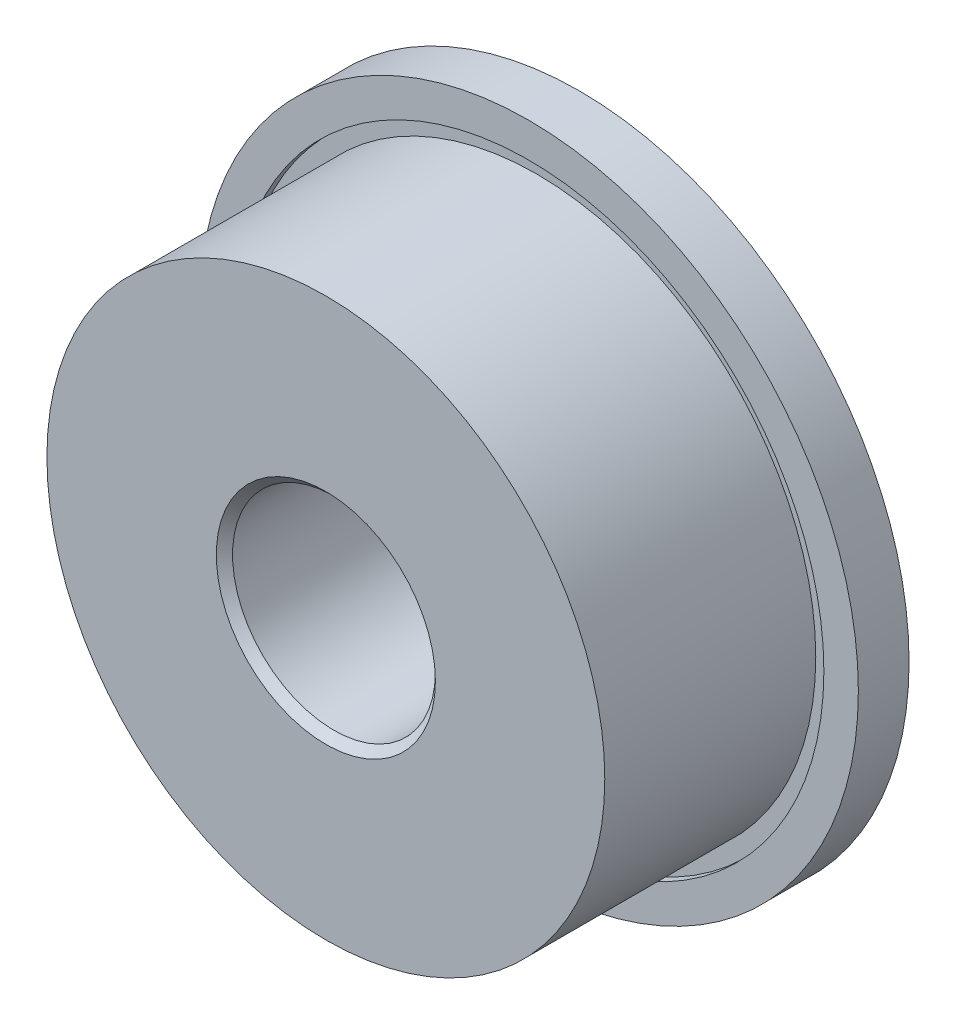
ISO-10303-21;
HEADER;
FILE_DESCRIPTION(('STEP AP214'),'2;1');
FILE_NAME('part.step','',(''),(''),'','','');
FILE_SCHEMA(('AUTOMOTIVE_DESIGN { 1 0 10303 214 1 1 1 1 }'));
ENDSEC;
DATA;
#1=APPLICATION_CONTEXT('core data for automotive mechanical design processes');
#2=APPLICATION_PROTOCOL_DEFINITION('international standard','automotive_design',2000,#1);
#3=PRODUCT_CONTEXT('',#1,'mechanical');
#4=PRODUCT('Part','Part','',(#3));
#5=PRODUCT_RELATED_PRODUCT_CATEGORY('part','',(#4));
#6=PRODUCT_DEFINITION_FORMATION('','',#4);
#7=PRODUCT_DEFINITION_CONTEXT('part definition',#1,'design');
#8=PRODUCT_DEFINITION('design','',#6,#7);
#9=PRODUCT_DEFINITION_SHAPE('','',#8);
#10=(LENGTH_UNIT() NAMED_UNIT(*) SI_UNIT(.MILLI.,.METRE.));
#11=(NAMED_UNIT(*) PLANE_ANGLE_UNIT() SI_UNIT($,.RADIAN.));
#12=(NAMED_UNIT(*) SI_UNIT($,.STERADIAN.) SOLID_ANGLE_UNIT());
#13=UNCERTAINTY_MEASURE_WITH_UNIT(LENGTH_MEASURE(1.E-05),#10,'distance_accuracy_value','');
#14=(GEOMETRIC_REPRESENTATION_CONTEXT(3) GLOBAL_UNCERTAINTY_ASSIGNED_CONTEXT((#13)) GLOBAL_UNIT_ASSIGNED_CONTEXT((#10,
#11,#12)) REPRESENTATION_CONTEXT('',''));
#15=CARTESIAN_POINT('',(0.,0.,0.));
#16=DIRECTION('',(0.,0.,1.));
#17=DIRECTION('',(1.,0.,0.));
#18=AXIS2_PLACEMENT_3D('',#15,#16,#17);
#19=CARTESIAN_POINT('',(0.,0.,1.5875));
#20=DIRECTION('',(0.,0.,-1.));
#21=DIRECTION('',(-1.,0.,0.));
#22=AXIS2_PLACEMENT_3D('',#19,#20,#21);
#23=CYLINDRICAL_SURFACE('',#22,10.31875);
#24=CARTESIAN_POINT('',(0.,0.,1.5875));
#25=DIRECTION('',(0.,0.,1.));
#26=DIRECTION('',(1.,0.,0.));
#27=AXIS2_PLACEMENT_3D('',#24,#25,#26);
#28=CIRCLE('',#27,10.31875);
#29=CARTESIAN_POINT('',(10.31875,0.,1.5875));
#30=VERTEX_POINT('',#29);
#31=EDGE_CURVE('E60',#30,#30,#28,.T.);
#32=ORIENTED_EDGE('',*,*,#31,.F.);
#33=EDGE_LOOP('',(#32));
#34=FACE_BOUND('',#33,.T.);
#35=CARTESIAN_POINT('',(0.,0.,0.));
#36=DIRECTION('',(0.,0.,1.));
#37=DIRECTION('',(1.,0.,0.));
#38=AXIS2_PLACEMENT_3D('',#35,#36,#37);
#39=CIRCLE('',#38,10.31875);
#40=CARTESIAN_POINT('',(10.31875,0.,0.));
#41=VERTEX_POINT('',#40);
#42=EDGE_CURVE('E61',#41,#41,#39,.T.);
#43=ORIENTED_EDGE('',*,*,#42,.T.);
#44=EDGE_LOOP('',(#43));
#45=FACE_BOUND('',#44,.T.);
#46=ADVANCED_FACE('F34',(#34,#45),#23,.T.);
#47=CARTESIAN_POINT('',(0.,0.,1.5875));
#48=DIRECTION('',(0.,0.,1.));
#49=DIRECTION('',(1.,0.,0.));
#50=AXIS2_PLACEMENT_3D('',#47,#48,#49);
#51=PLANE('',#50);
#52=CARTESIAN_POINT('',(0.,0.,1.5875));
#53=DIRECTION('',(0.,0.,1.));
#54=DIRECTION('',(1.,0.,0.));
#55=AXIS2_PLACEMENT_3D('',#52,#53,#54);
#56=CIRCLE('',#55,9.23925);
#57=CARTESIAN_POINT('',(9.23925,0.,1.5875));
#58=VERTEX_POINT('',#57);
#59=EDGE_CURVE('E82',#58,#58,#56,.T.);
#60=ORIENTED_EDGE('',*,*,#59,.F.);
#61=EDGE_LOOP('',(#60));
#62=FACE_BOUND('',#61,.T.);
#63=ORIENTED_EDGE('',*,*,#31,.T.);
#64=EDGE_LOOP('',(#63));
#65=FACE_BOUND('',#64,.T.);
#66=ADVANCED_FACE('F107',(#62,#65),#51,.T.);
#67=CARTESIAN_POINT('',(0.,0.,0.));
#68=DIRECTION('',(0.,0.,1.));
#69=DIRECTION('',(1.,0.,0.));
#70=AXIS2_PLACEMENT_3D('',#67,#68,#69);
#71=PLANE('',#70);
#72=CARTESIAN_POINT('',(0.,0.,0.));
#73=DIRECTION('',(0.,0.,1.));
#74=DIRECTION('',(1.,0.,0.));
#75=AXIS2_PLACEMENT_3D('',#72,#73,#74);
#76=CIRCLE('',#75,6.35);
#77=CARTESIAN_POINT('',(6.35,0.,0.));
#78=VERTEX_POINT('',#77);
#79=EDGE_CURVE('E57',#78,#78,#76,.F.);
#80=ORIENTED_EDGE('',*,*,#79,.F.);
#81=EDGE_LOOP('',(#80));
#82=FACE_BOUND('',#81,.T.);
#83=ORIENTED_EDGE('',*,*,#42,.F.);
#84=EDGE_LOOP('',(#83));
#85=FACE_BOUND('',#84,.T.);
#86=ADVANCED_FACE('F110',(#82,#85),#71,.F.);
#87=CARTESIAN_POINT('',(0.,0.,-1.5875));
#88=DIRECTION('',(0.,0.,1.));
#89=DIRECTION('',(1.,0.,0.));
#90=AXIS2_PLACEMENT_3D('',#87,#88,#89);
#91=CYLINDRICAL_SURFACE('',#90,6.35);
#92=CARTESIAN_POINT('',(0.,0.,-1.5875));
#93=DIRECTION('',(0.,0.,-1.));
#94=DIRECTION('',(-1.,0.,0.));
#95=AXIS2_PLACEMENT_3D('',#92,#93,#94);
#96=CIRCLE('',#95,6.35);
#97=CARTESIAN_POINT('',(-6.35,0.,-1.5875));
#98=VERTEX_POINT('',#97);
#99=EDGE_CURVE('E69',#98,#98,#96,.T.);
#100=ORIENTED_EDGE('',*,*,#99,.F.);
#101=EDGE_LOOP('',(#100));
#102=FACE_BOUND('',#101,.T.);
#103=ORIENTED_EDGE('',*,*,#79,.T.);
#104=EDGE_LOOP('',(#103));
#105=FACE_BOUND('',#104,.T.);
#106=ADVANCED_FACE('F120',(#102,#105),#91,.T.);
#107=CARTESIAN_POINT('',(0.,0.,-1.5875));
#108=DIRECTION('',(0.,0.,-1.));
#109=DIRECTION('',(-1.,0.,0.));
#110=AXIS2_PLACEMENT_3D('',#107,#108,#109);
#111=PLANE('',#110);
#112=CARTESIAN_POINT('',(0.,0.,-1.5875));
#113=DIRECTION('',(0.,0.,-1.));
#114=DIRECTION('',(-1.,0.,0.));
#115=AXIS2_PLACEMENT_3D('',#112,#113,#114);
#116=CIRCLE('',#115,4.7625);
#117=CARTESIAN_POINT('',(-4.7625,0.,-1.5875));
#118=VERTEX_POINT('',#117);
#119=EDGE_CURVE('E73',#118,#118,#116,.T.);
#120=ORIENTED_EDGE('',*,*,#119,.F.);
#121=EDGE_LOOP('',(#120));
#122=FACE_BOUND('',#121,.T.);
#123=ORIENTED_EDGE('',*,*,#99,.T.);
#124=EDGE_LOOP('',(#123));
#125=FACE_BOUND('',#124,.T.);
#126=ADVANCED_FACE('F126',(#122,#125),#111,.T.);
#127=CARTESIAN_POINT('',(0.,0.,-1.3335));
#128=DIRECTION('',(0.,0.,-1.));
#129=DIRECTION('',(-1.,0.,0.));
#130=AXIS2_PLACEMENT_3D('',#127,#128,#129);
#131=CYLINDRICAL_SURFACE('',#130,4.7625);
#132=CARTESIAN_POINT('',(0.,0.,-1.3335));
#133=DIRECTION('',(0.,0.,-1.));
#134=DIRECTION('',(-1.,0.,0.));
#135=AXIS2_PLACEMENT_3D('',#132,#133,#134);
#136=CIRCLE('',#135,4.7625);
#137=CARTESIAN_POINT('',(-4.7625,0.,-1.3335));
#138=VERTEX_POINT('',#137);
#139=EDGE_CURVE('E72',#138,#138,#136,.T.);
#140=ORIENTED_EDGE('',*,*,#139,.F.);
#141=EDGE_LOOP('',(#140));
#142=FACE_BOUND('',#141,.T.);
#143=ORIENTED_EDGE('',*,*,#119,.T.);
#144=EDGE_LOOP('',(#143));
#145=FACE_BOUND('',#144,.T.);
#146=ADVANCED_FACE('F153',(#142,#145),#131,.F.);
#147=CARTESIAN_POINT('',(0.,0.,-1.3335));
#148=DIRECTION('',(0.,0.,-1.));
#149=DIRECTION('',(-1.,0.,0.));
#150=AXIS2_PLACEMENT_3D('',#147,#148,#149);
#151=PLANE('',#150);
#152=CARTESIAN_POINT('',(0.,0.,-1.3335));
#153=DIRECTION('',(0.,0.,-1.));
#154=DIRECTION('',(-1.,0.,0.));
#155=AXIS2_PLACEMENT_3D('',#152,#153,#154);
#156=CIRCLE('',#155,3.96875);
#157=CARTESIAN_POINT('',(-3.96875,0.,-1.3335));
#158=VERTEX_POINT('',#157);
#159=EDGE_CURVE('E76',#158,#158,#156,.T.);
#160=ORIENTED_EDGE('',*,*,#159,.F.);
#161=EDGE_LOOP('',(#160));
#162=FACE_BOUND('',#161,.T.);
#163=ORIENTED_EDGE('',*,*,#139,.T.);
#164=EDGE_LOOP('',(#163));
#165=FACE_BOUND('',#164,.T.);
#166=ADVANCED_FACE('F147',(#162,#165),#151,.T.);
#167=CARTESIAN_POINT('',(0.,0.,-1.5875));
#168=DIRECTION('',(0.,0.,-1.));
#169=DIRECTION('',(-1.,0.,0.));
#170=AXIS2_PLACEMENT_3D('',#167,#168,#169);
#171=CIRCLE('',#170,3.71475000000001);
#172=CARTESIAN_POINT('',(-3.71475000000001,0.,-1.5875));
#173=VERTEX_POINT('',#172);
#174=EDGE_CURVE('E49',#173,#173,#171,.T.);
#175=ORIENTED_EDGE('',*,*,#174,.T.);
#176=EDGE_LOOP('',(#175));
#177=FACE_BOUND('',#176,.T.);
#178=CARTESIAN_POINT('',(0.,0.,-1.5875));
#179=DIRECTION('',(0.,0.,-1.));
#180=DIRECTION('',(-1.,0.,0.));
#181=AXIS2_PLACEMENT_3D('',#178,#179,#180);
#182=CIRCLE('',#181,3.42899999999998);
#183=CARTESIAN_POINT('',(-3.42899999999998,0.,-1.5875));
#184=VERTEX_POINT('',#183);
#185=EDGE_CURVE('E54',#184,#184,#182,.F.);
#186=ORIENTED_EDGE('',*,*,#185,.T.);
#187=EDGE_LOOP('',(#186));
#188=FACE_BOUND('',#187,.T.);
#189=ADVANCED_FACE('F103',(#177,#188),#111,.T.);
#190=CARTESIAN_POINT('',(0.,0.,1.3335));
#191=DIRECTION('',(0.,0.,1.));
#192=DIRECTION('',(1.,0.,0.));
#193=AXIS2_PLACEMENT_3D('',#190,#191,#192);
#194=CYLINDRICAL_SURFACE('',#193,9.23925);
#195=CARTESIAN_POINT('',(0.,0.,1.3335));
#196=DIRECTION('',(0.,0.,1.));
#197=DIRECTION('',(1.,0.,0.));
#198=AXIS2_PLACEMENT_3D('',#195,#196,#197);
#199=CIRCLE('',#198,9.23925);
#200=CARTESIAN_POINT('',(9.23925,0.,1.3335));
#201=VERTEX_POINT('',#200);
#202=EDGE_CURVE('E81',#201,#201,#199,.T.);
#203=ORIENTED_EDGE('',*,*,#202,.F.);
#204=EDGE_LOOP('',(#203));
#205=FACE_BOUND('',#204,.T.);
#206=ORIENTED_EDGE('',*,*,#59,.T.);
#207=EDGE_LOOP('',(#206));
#208=FACE_BOUND('',#207,.T.);
#209=ADVANCED_FACE('F97',(#205,#208),#194,.F.);
#210=CARTESIAN_POINT('',(0.,0.,1.3335));
#211=DIRECTION('',(0.,0.,1.));
#212=DIRECTION('',(1.,0.,0.));
#213=AXIS2_PLACEMENT_3D('',#210,#211,#212);
#214=PLANE('',#213);
#215=CARTESIAN_POINT('',(0.,0.,1.3335));
#216=DIRECTION('',(0.,0.,1.));
#217=DIRECTION('',(1.,0.,0.));
#218=AXIS2_PLACEMENT_3D('',#215,#216,#217);
#219=CIRCLE('',#218,8.73125);
#220=CARTESIAN_POINT('',(8.73125,0.,1.3335));
#221=VERTEX_POINT('',#220);
#222=EDGE_CURVE('E85',#221,#221,#219,.T.);
#223=ORIENTED_EDGE('',*,*,#222,.F.);
#224=EDGE_LOOP('',(#223));
#225=FACE_BOUND('',#224,.T.);
#226=ORIENTED_EDGE('',*,*,#202,.T.);
#227=EDGE_LOOP('',(#226));
#228=FACE_BOUND('',#227,.T.);
#229=ADVANCED_FACE('F93',(#225,#228),#214,.T.);
#230=CARTESIAN_POINT('',(0.,0.,7.9375));
#231=DIRECTION('',(0.,0.,1.));
#232=DIRECTION('',(1.,0.,0.));
#233=AXIS2_PLACEMENT_3D('',#230,#231,#232);
#234=PLANE('',#233);
#235=CARTESIAN_POINT('',(0.,0.,7.9375));
#236=DIRECTION('',(0.,0.,1.));
#237=DIRECTION('',(1.,0.,0.));
#238=AXIS2_PLACEMENT_3D('',#235,#236,#237);
#239=CIRCLE('',#238,3.42900000000001);
#240=CARTESIAN_POINT('',(3.42900000000001,0.,7.9375));
#241=VERTEX_POINT('',#240);
#242=EDGE_CURVE('E10',#241,#241,#239,.F.);
#243=ORIENTED_EDGE('',*,*,#242,.T.);
#244=EDGE_LOOP('',(#243));
#245=FACE_BOUND('',#244,.T.);
#246=CARTESIAN_POINT('',(0.,0.,7.9375));
#247=DIRECTION('',(0.,0.,1.));
#248=DIRECTION('',(1.,0.,0.));
#249=AXIS2_PLACEMENT_3D('',#246,#247,#248);
#250=CIRCLE('',#249,8.73125);
#251=CARTESIAN_POINT('',(8.73125,0.,7.9375));
#252=VERTEX_POINT('',#251);
#253=EDGE_CURVE('E64',#252,#252,#250,.T.);
#254=ORIENTED_EDGE('',*,*,#253,.T.);
#255=EDGE_LOOP('',(#254));
#256=FACE_BOUND('',#255,.T.);
#257=ADVANCED_FACE('F96',(#245,#256),#234,.T.);
#258=CARTESIAN_POINT('',(0.,0.,7.9375));
#259=DIRECTION('',(0.,0.,-1.));
#260=DIRECTION('',(-1.,0.,0.));
#261=AXIS2_PLACEMENT_3D('',#258,#259,#260);
#262=CYLINDRICAL_SURFACE('',#261,8.73125);
#263=ORIENTED_EDGE('',*,*,#253,.F.);
#264=EDGE_LOOP('',(#263));
#265=FACE_BOUND('',#264,.T.);
#266=ORIENTED_EDGE('',*,*,#222,.T.);
#267=EDGE_LOOP('',(#266));
#268=FACE_BOUND('',#267,.T.);
#269=ADVANCED_FACE('F91',(#265,#268),#262,.T.);
#270=CARTESIAN_POINT('',(0.,0.,-1.5875));
#271=DIRECTION('',(0.,0.,1.));
#272=DIRECTION('',(1.,0.,0.));
#273=AXIS2_PLACEMENT_3D('',#270,#271,#272);
#274=CYLINDRICAL_SURFACE('',#273,3.175);
#275=CARTESIAN_POINT('',(0.,0.,-1.33350000000002));
#276=DIRECTION('',(0.,0.,-1.));
#277=DIRECTION('',(-1.,0.,0.));
#278=AXIS2_PLACEMENT_3D('',#275,#276,#277);
#279=CIRCLE('',#278,3.175);
#280=CARTESIAN_POINT('',(3.175,0.,-1.33350000000002));
#281=VERTEX_POINT('',#280);
#282=EDGE_CURVE('E41',#281,#281,#279,.T.);
#283=CARTESIAN_POINT('',(0.,0.,7.68349999999999));
#284=DIRECTION('',(0.,0.,1.));
#285=DIRECTION('',(1.,0.,0.));
#286=AXIS2_PLACEMENT_3D('',#283,#284,#285);
#287=CIRCLE('',#286,3.175);
#288=CARTESIAN_POINT('',(3.175,0.,7.68349999999999));
#289=VERTEX_POINT('',#288);
#290=EDGE_CURVE('E45',#289,#289,#287,.T.);
#291=CARTESIAN_POINT('',(3.175,0.,-1.33350000000002));
#292=CARTESIAN_POINT('',(3.175,0.,-1.23957291666669));
#293=CARTESIAN_POINT('',(3.175,0.,-1.14564583333335));
#294=CARTESIAN_POINT('',(3.175,0.,-0.957791666666686));
#295=CARTESIAN_POINT('',(3.175,0.,-0.863864583333353));
#296=CARTESIAN_POINT('',(3.175,0.,-0.676010416666686));
#297=CARTESIAN_POINT('',(3.175,0.,-0.582083333333353));
#298=CARTESIAN_POINT('',(3.175,0.,-0.394229166666686));
#299=CARTESIAN_POINT('',(3.175,0.,-0.300302083333352));
#300=CARTESIAN_POINT('',(3.175,0.,-0.112447916666686));
#301=CARTESIAN_POINT('',(3.175,0.,-0.0185208333333521));
#302=CARTESIAN_POINT('',(3.175,0.,0.169333333333315));
#303=CARTESIAN_POINT('',(3.175,0.,0.263260416666648));
#304=CARTESIAN_POINT('',(3.175,0.,0.451114583333315));
#305=CARTESIAN_POINT('',(3.175,0.,0.545041666666648));
#306=CARTESIAN_POINT('',(3.175,0.,0.732895833333315));
#307=CARTESIAN_POINT('',(3.175,0.,0.826822916666648));
#308=CARTESIAN_POINT('',(3.175,0.,1.01467708333332));
#309=CARTESIAN_POINT('',(3.175,0.,1.10860416666665));
#310=CARTESIAN_POINT('',(3.175,0.,1.29645833333332));
#311=CARTESIAN_POINT('',(3.175,0.,1.39038541666665));
#312=CARTESIAN_POINT('',(3.175,0.,1.57823958333332));
#313=CARTESIAN_POINT('',(3.175,0.,1.67216666666665));
#314=CARTESIAN_POINT('',(3.175,0.,1.86002083333332));
#315=CARTESIAN_POINT('',(3.175,0.,1.95394791666665));
#316=CARTESIAN_POINT('',(3.175,0.,2.14180208333332));
#317=CARTESIAN_POINT('',(3.175,0.,2.23572916666665));
#318=CARTESIAN_POINT('',(3.175,0.,2.42358333333332));
#319=CARTESIAN_POINT('',(3.175,0.,2.51751041666665));
#320=CARTESIAN_POINT('',(3.175,0.,2.70536458333332));
#321=CARTESIAN_POINT('',(3.175,0.,2.79929166666665));
#322=CARTESIAN_POINT('',(3.175,0.,2.98714583333332));
#323=CARTESIAN_POINT('',(3.175,0.,3.08107291666665));
#324=CARTESIAN_POINT('',(3.175,0.,3.26892708333332));
#325=CARTESIAN_POINT('',(3.175,0.,3.36285416666665));
#326=CARTESIAN_POINT('',(3.175,0.,3.55070833333332));
#327=CARTESIAN_POINT('',(3.175,0.,3.64463541666665));
#328=CARTESIAN_POINT('',(3.175,0.,3.83248958333332));
#329=CARTESIAN_POINT('',(3.175,0.,3.92641666666665));
#330=CARTESIAN_POINT('',(3.175,0.,4.11427083333332));
#331=CARTESIAN_POINT('',(3.175,0.,4.20819791666665));
#332=CARTESIAN_POINT('',(3.175,0.,4.39605208333332));
#333=CARTESIAN_POINT('',(3.175,0.,4.48997916666665));
#334=CARTESIAN_POINT('',(3.175,0.,4.67783333333332));
#335=CARTESIAN_POINT('',(3.175,0.,4.77176041666665));
#336=CARTESIAN_POINT('',(3.175,0.,4.95961458333332));
#337=CARTESIAN_POINT('',(3.175,0.,5.05354166666665));
#338=CARTESIAN_POINT('',(3.175,0.,5.24139583333332));
#339=CARTESIAN_POINT('',(3.175,0.,5.33532291666665));
#340=CARTESIAN_POINT('',(3.175,0.,5.52317708333332));
#341=CARTESIAN_POINT('',(3.175,0.,5.61710416666665));
#342=CARTESIAN_POINT('',(3.175,0.,5.80495833333332));
#343=CARTESIAN_POINT('',(3.175,0.,5.89888541666665));
#344=CARTESIAN_POINT('',(3.175,0.,6.08673958333332));
#345=CARTESIAN_POINT('',(3.175,0.,6.18066666666665));
#346=CARTESIAN_POINT('',(3.175,0.,6.36852083333332));
#347=CARTESIAN_POINT('',(3.175,0.,6.46244791666665));
#348=CARTESIAN_POINT('',(3.175,0.,6.65030208333332));
#349=CARTESIAN_POINT('',(3.175,0.,6.74422916666665));
#350=CARTESIAN_POINT('',(3.175,0.,6.93208333333332));
#351=CARTESIAN_POINT('',(3.175,0.,7.02601041666665));
#352=CARTESIAN_POINT('',(3.175,0.,7.21386458333332));
#353=CARTESIAN_POINT('',(3.175,0.,7.30779166666665));
#354=CARTESIAN_POINT('',(3.175,0.,7.49564583333332));
#355=CARTESIAN_POINT('',(3.175,0.,7.58957291666665));
#356=CARTESIAN_POINT('',(3.175,0.,7.68349999999999));
#357=B_SPLINE_CURVE_WITH_KNOTS('',3,(#291,#292,#293,#294,#295,#296,#297,#298,#299,#300,#301,
#302,#303,#304,#305,#306,#307,#308,#309,#310,#311,#312,#313,#314,#315,#316,#317,#318,#319,#320,
#321,#322,#323,#324,#325,#326,#327,#328,#329,#330,#331,#332,#333,#334,#335,#336,#337,#338,#339,
#340,#341,#342,#343,#344,#345,#346,#347,#348,#349,#350,#351,#352,#353,#354,#355,#356),
.UNSPECIFIED.,.F.,.F.,(4,2,2,2,2,2,2,2,2,2,2,2,2,2,2,2,2,2,2,2,2,2,2,2,2,2,2,2,2,2,2,2,4),(0.,
0.28178125,0.5635625,0.845343750000001,1.127125,1.40890625,1.6906875,1.97246875,2.25425,
2.53603125,2.8178125,3.09959375,3.381375,3.66315625,3.9449375,4.22671875,4.5085,4.79028125,
5.0720625,5.35384375,5.635625,5.91740625,6.1991875,6.48096875000001,6.76275,7.04453125,
7.32631250000001,7.60809375,7.889875,8.17165625000001,8.45343750000001,8.73521875000001,
9.01700000000001),.UNSPECIFIED.);
#358=EDGE_CURVE('BSEAM135',#281,#289,#357,.T.);
#359=ORIENTED_EDGE('',*,*,#282,.T.);
#360=ORIENTED_EDGE('',*,*,#290,.T.);
#361=ORIENTED_EDGE('',*,*,#358,.T.);
#362=ORIENTED_EDGE('',*,*,#358,.F.);
#363=EDGE_LOOP('',(#359,#361,#360,#362));
#364=FACE_BOUND('',#363,.T.);
#365=ADVANCED_FACE('F135',(#364),#274,.F.);
#366=CARTESIAN_POINT('',(0.,0.,-1.5875));
#367=DIRECTION('',(0.,0.,1.));
#368=DIRECTION('',(1.,0.,0.));
#369=AXIS2_PLACEMENT_3D('',#366,#367,#368);
#370=CONICAL_SURFACE('',#369,3.71475000000001,0.785398163397442);
#371=ORIENTED_EDGE('',*,*,#159,.T.);
#372=EDGE_LOOP('',(#371));
#373=FACE_BOUND('',#372,.T.);
#374=ORIENTED_EDGE('',*,*,#174,.F.);
#375=EDGE_LOOP('',(#374));
#376=FACE_BOUND('',#375,.T.);
#377=ADVANCED_FACE('F132',(#373,#376),#370,.T.);
#378=CARTESIAN_POINT('',(0.,0.,-1.5875));
#379=DIRECTION('',(0.,0.,-1.));
#380=DIRECTION('',(-1.,0.,0.));
#381=AXIS2_PLACEMENT_3D('',#378,#379,#380);
#382=CONICAL_SURFACE('',#381,3.42899999999998,0.785398163397449);
#383=ORIENTED_EDGE('',*,*,#282,.F.);
#384=EDGE_LOOP('',(#383));
#385=FACE_BOUND('',#384,.T.);
#386=ORIENTED_EDGE('',*,*,#185,.F.);
#387=EDGE_LOOP('',(#386));
#388=FACE_BOUND('',#387,.T.);
#389=ADVANCED_FACE('F134',(#385,#388),#382,.F.);
#390=CARTESIAN_POINT('',(0.,0.,7.68349999999999));
#391=DIRECTION('',(0.,0.,1.));
#392=DIRECTION('',(1.,0.,0.));
#393=AXIS2_PLACEMENT_3D('',#390,#391,#392);
#394=CONICAL_SURFACE('',#393,3.175,0.785398163397453);
#395=ORIENTED_EDGE('',*,*,#242,.F.);
#396=EDGE_LOOP('',(#395));
#397=FACE_BOUND('',#396,.T.);
#398=ORIENTED_EDGE('',*,*,#290,.F.);
#399=EDGE_LOOP('',(#398));
#400=FACE_BOUND('',#399,.T.);
#401=ADVANCED_FACE('F36',(#397,#400),#394,.F.);
#402=CLOSED_SHELL('',(#46,#66,#86,#106,#126,#146,#166,#189,#209,#229,#257,#269,#365,#377,#389,#401));
#403=MANIFOLD_SOLID_BREP('B2',#402);
#404=ADVANCED_BREP_SHAPE_REPRESENTATION('',(#18,#403),#14);
#405=SHAPE_DEFINITION_REPRESENTATION(#9,#404);
ENDSEC;
END-ISO-10303-21;
